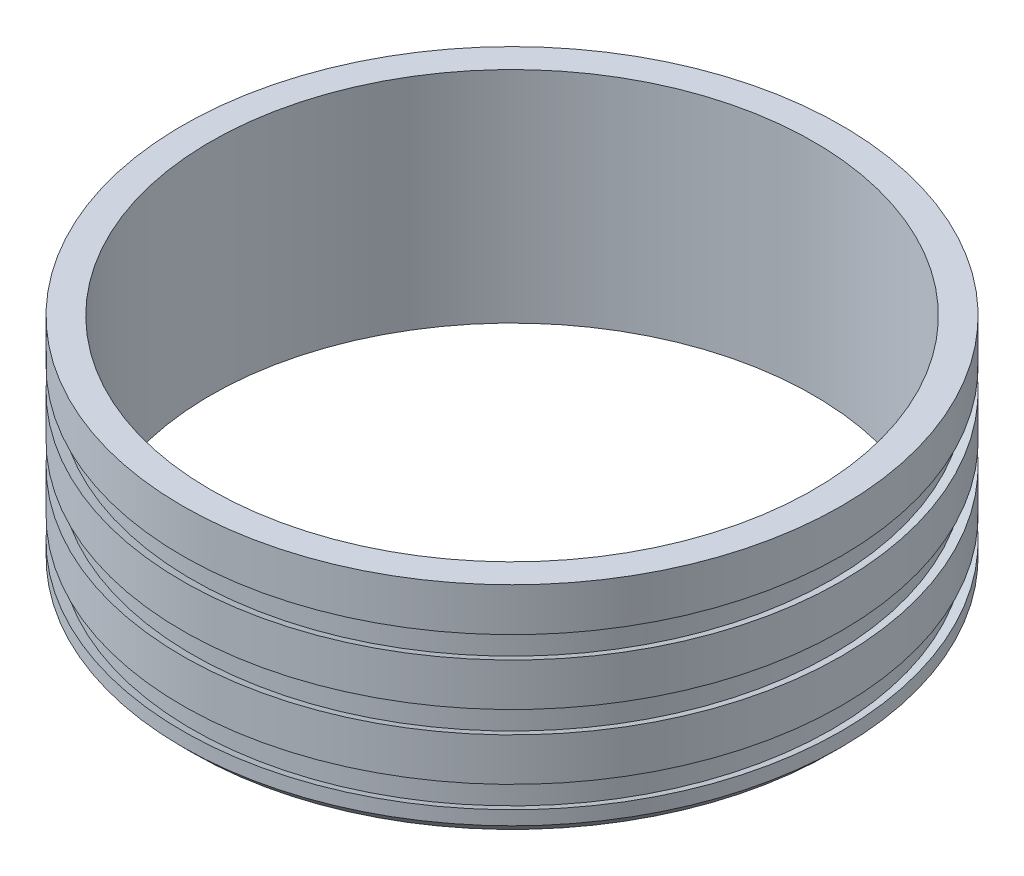
ISO-10303-21;
HEADER;
FILE_DESCRIPTION(('STEP AP214'),'2;1');
FILE_NAME('part.step','',(''),(''),'','','');
FILE_SCHEMA(('AUTOMOTIVE_DESIGN { 1 0 10303 214 1 1 1 1 }'));
ENDSEC;
DATA;
#1=APPLICATION_CONTEXT('core data for automotive mechanical design processes');
#2=APPLICATION_PROTOCOL_DEFINITION('international standard','automotive_design',2000,#1);
#3=PRODUCT_CONTEXT('',#1,'mechanical');
#4=PRODUCT('Part','Part','',(#3));
#5=PRODUCT_RELATED_PRODUCT_CATEGORY('part','',(#4));
#6=PRODUCT_DEFINITION_FORMATION('','',#4);
#7=PRODUCT_DEFINITION_CONTEXT('part definition',#1,'design');
#8=PRODUCT_DEFINITION('design','',#6,#7);
#9=PRODUCT_DEFINITION_SHAPE('','',#8);
#10=(LENGTH_UNIT() NAMED_UNIT(*) SI_UNIT(.MILLI.,.METRE.));
#11=(NAMED_UNIT(*) PLANE_ANGLE_UNIT() SI_UNIT($,.RADIAN.));
#12=(NAMED_UNIT(*) SI_UNIT($,.STERADIAN.) SOLID_ANGLE_UNIT());
#13=UNCERTAINTY_MEASURE_WITH_UNIT(LENGTH_MEASURE(1.E-05),#10,'distance_accuracy_value','');
#14=(GEOMETRIC_REPRESENTATION_CONTEXT(3) GLOBAL_UNCERTAINTY_ASSIGNED_CONTEXT((#13)) GLOBAL_UNIT_ASSIGNED_CONTEXT((#10,
#11,#12)) REPRESENTATION_CONTEXT('',''));
#15=CARTESIAN_POINT('',(0.,0.,0.));
#16=DIRECTION('',(0.,0.,1.));
#17=DIRECTION('',(1.,0.,0.));
#18=AXIS2_PLACEMENT_3D('',#15,#16,#17);
#19=CARTESIAN_POINT('',(0.,50.8,0.));
#20=DIRECTION('',(0.,-1.,0.));
#21=DIRECTION('',(0.,0.,-1.));
#22=AXIS2_PLACEMENT_3D('',#19,#20,#21);
#23=CYLINDRICAL_SURFACE('',#22,76.25);
#24=CARTESIAN_POINT('',(0.,50.8,0.));
#25=DIRECTION('',(0.,1.,0.));
#26=DIRECTION('',(0.,0.,1.));
#27=AXIS2_PLACEMENT_3D('',#24,#25,#26);
#28=CIRCLE('',#27,76.25);
#29=CARTESIAN_POINT('',(0.,50.8,76.25));
#30=VERTEX_POINT('',#29);
#31=EDGE_CURVE('E57',#30,#30,#28,.T.);
#32=ORIENTED_EDGE('',*,*,#31,.F.);
#33=EDGE_LOOP('',(#32));
#34=FACE_BOUND('',#33,.T.);
#35=CARTESIAN_POINT('',(0.,40.8,0.));
#36=DIRECTION('',(0.,-1.,0.));
#37=DIRECTION('',(1.,0.,0.));
#38=AXIS2_PLACEMENT_3D('',#35,#36,#37);
#39=CIRCLE('',#38,76.25);
#40=CARTESIAN_POINT('',(76.25,40.7999999999999,0.));
#41=VERTEX_POINT('',#40);
#42=EDGE_CURVE('E109',#41,#41,#39,.T.);
#43=ORIENTED_EDGE('',*,*,#42,.F.);
#44=EDGE_LOOP('',(#43));
#45=FACE_BOUND('',#44,.T.);
#46=ADVANCED_FACE('F43',(#34,#45),#23,.T.);
#47=CARTESIAN_POINT('',(0.,2.49999999999999,0.));
#48=DIRECTION('',(0.,1.,0.));
#49=DIRECTION('',(0.,0.,1.));
#50=AXIS2_PLACEMENT_3D('',#47,#48,#49);
#51=CIRCLE('',#50,76.25);
#52=CARTESIAN_POINT('',(0.,2.49999999999999,76.25));
#53=VERTEX_POINT('',#52);
#54=EDGE_CURVE('E52',#53,#53,#51,.T.);
#55=ORIENTED_EDGE('',*,*,#54,.T.);
#56=EDGE_LOOP('',(#55));
#57=FACE_BOUND('',#56,.T.);
#58=CARTESIAN_POINT('',(0.,5.71999999999995,0.));
#59=DIRECTION('',(0.,-1.,0.));
#60=DIRECTION('',(1.,0.,0.));
#61=AXIS2_PLACEMENT_3D('',#58,#59,#60);
#62=CIRCLE('',#61,76.25);
#63=CARTESIAN_POINT('',(76.2499999999999,5.71999999999991,0.));
#64=VERTEX_POINT('',#63);
#65=EDGE_CURVE('E73',#64,#64,#62,.T.);
#66=ORIENTED_EDGE('',*,*,#65,.T.);
#67=EDGE_LOOP('',(#66));
#68=FACE_BOUND('',#67,.T.);
#69=ADVANCED_FACE('F136',(#57,#68),#23,.T.);
#70=CARTESIAN_POINT('',(0.,50.8,0.));
#71=DIRECTION('',(0.,1.,0.));
#72=DIRECTION('',(0.,0.,1.));
#73=AXIS2_PLACEMENT_3D('',#70,#71,#72);
#74=PLANE('',#73);
#75=ORIENTED_EDGE('',*,*,#31,.T.);
#76=EDGE_LOOP('',(#75));
#77=FACE_BOUND('',#76,.T.);
#78=CARTESIAN_POINT('',(0.,50.8,0.));
#79=DIRECTION('',(0.,1.,0.));
#80=DIRECTION('',(0.,0.,1.));
#81=AXIS2_PLACEMENT_3D('',#78,#79,#80);
#82=CIRCLE('',#81,69.75);
#83=CARTESIAN_POINT('',(0.,50.8,69.75));
#84=VERTEX_POINT('',#83);
#85=EDGE_CURVE('E62',#84,#84,#82,.T.);
#86=ORIENTED_EDGE('',*,*,#85,.F.);
#87=EDGE_LOOP('',(#86));
#88=FACE_BOUND('',#87,.T.);
#89=ADVANCED_FACE('F144',(#77,#88),#74,.T.);
#90=CARTESIAN_POINT('',(0.,0.,0.));
#91=DIRECTION('',(0.,1.,0.));
#92=DIRECTION('',(0.,0.,1.));
#93=AXIS2_PLACEMENT_3D('',#90,#91,#92);
#94=PLANE('',#93);
#95=CARTESIAN_POINT('',(0.,0.,0.));
#96=DIRECTION('',(0.,1.,0.));
#97=DIRECTION('',(0.,0.,1.));
#98=AXIS2_PLACEMENT_3D('',#95,#96,#97);
#99=CIRCLE('',#98,73.75);
#100=CARTESIAN_POINT('',(0.,0.,73.75));
#101=VERTEX_POINT('',#100);
#102=EDGE_CURVE('E10',#101,#101,#99,.F.);
#103=ORIENTED_EDGE('',*,*,#102,.T.);
#104=EDGE_LOOP('',(#103));
#105=FACE_BOUND('',#104,.T.);
#106=CARTESIAN_POINT('',(0.,0.,0.));
#107=DIRECTION('',(0.,1.,0.));
#108=DIRECTION('',(0.,0.,1.));
#109=AXIS2_PLACEMENT_3D('',#106,#107,#108);
#110=CIRCLE('',#109,69.75);
#111=CARTESIAN_POINT('',(0.,0.,69.75));
#112=VERTEX_POINT('',#111);
#113=EDGE_CURVE('E65',#112,#112,#110,.T.);
#114=ORIENTED_EDGE('',*,*,#113,.T.);
#115=EDGE_LOOP('',(#114));
#116=FACE_BOUND('',#115,.T.);
#117=ADVANCED_FACE('F187',(#105,#116),#94,.F.);
#118=CARTESIAN_POINT('',(0.,50.8,0.));
#119=DIRECTION('',(0.,-1.,0.));
#120=DIRECTION('',(0.,0.,-1.));
#121=AXIS2_PLACEMENT_3D('',#118,#119,#120);
#122=CYLINDRICAL_SURFACE('',#121,69.75);
#123=ORIENTED_EDGE('',*,*,#85,.T.);
#124=EDGE_LOOP('',(#123));
#125=FACE_BOUND('',#124,.T.);
#126=ORIENTED_EDGE('',*,*,#113,.F.);
#127=EDGE_LOOP('',(#126));
#128=FACE_BOUND('',#127,.T.);
#129=ADVANCED_FACE('F183',(#125,#128),#122,.F.);
#130=CARTESIAN_POINT('',(0.,5.71999999999995,0.));
#131=DIRECTION('',(0.,1.,0.));
#132=DIRECTION('',(-1.,0.,0.));
#133=AXIS2_PLACEMENT_3D('',#130,#131,#132);
#134=CONICAL_SURFACE('',#133,76.25,1.22173047639603);
#135=CARTESIAN_POINT('',(0.,4.90106697290099,0.));
#136=DIRECTION('',(0.,-1.,0.));
#137=DIRECTION('',(1.,0.,0.));
#138=AXIS2_PLACEMENT_3D('',#135,#136,#137);
#139=CIRCLE('',#138,74.);
#140=CARTESIAN_POINT('',(73.9999999999999,4.90106697290094,0.));
#141=VERTEX_POINT('',#140);
#142=EDGE_CURVE('E86',#141,#141,#139,.T.);
#143=ORIENTED_EDGE('',*,*,#142,.T.);
#144=EDGE_LOOP('',(#143));
#145=FACE_BOUND('',#144,.T.);
#146=ORIENTED_EDGE('',*,*,#65,.F.);
#147=EDGE_LOOP('',(#146));
#148=FACE_BOUND('',#147,.T.);
#149=ADVANCED_FACE('F179',(#145,#148),#134,.F.);
#150=CARTESIAN_POINT('',(0.,11.6189330270989,0.));
#151=DIRECTION('',(0.,-1.,0.));
#152=DIRECTION('',(1.,0.,0.));
#153=AXIS2_PLACEMENT_3D('',#150,#151,#152);
#154=CONICAL_SURFACE('',#153,74.,1.22173047639603);
#155=CARTESIAN_POINT('',(0.,10.8,0.));
#156=DIRECTION('',(0.,-1.,0.));
#157=DIRECTION('',(1.,0.,0.));
#158=AXIS2_PLACEMENT_3D('',#155,#156,#157);
#159=CIRCLE('',#158,76.25);
#160=CARTESIAN_POINT('',(76.2499999999999,10.7999999999999,0.));
#161=VERTEX_POINT('',#160);
#162=EDGE_CURVE('E78',#161,#161,#159,.T.);
#163=ORIENTED_EDGE('',*,*,#162,.T.);
#164=EDGE_LOOP('',(#163));
#165=FACE_BOUND('',#164,.T.);
#166=CARTESIAN_POINT('',(0.,11.6189330270989,0.));
#167=DIRECTION('',(0.,-1.,0.));
#168=DIRECTION('',(1.,0.,0.));
#169=AXIS2_PLACEMENT_3D('',#166,#167,#168);
#170=CIRCLE('',#169,74.);
#171=CARTESIAN_POINT('',(73.9999999999999,11.6189330270989,0.));
#172=VERTEX_POINT('',#171);
#173=EDGE_CURVE('E82',#172,#172,#170,.T.);
#174=ORIENTED_EDGE('',*,*,#173,.F.);
#175=EDGE_LOOP('',(#174));
#176=FACE_BOUND('',#175,.T.);
#177=ADVANCED_FACE('F166',(#165,#176),#154,.F.);
#178=CARTESIAN_POINT('',(0.,0.,0.));
#179=DIRECTION('',(0.,-1.,0.));
#180=DIRECTION('',(1.,0.,0.));
#181=AXIS2_PLACEMENT_3D('',#178,#179,#180);
#182=CYLINDRICAL_SURFACE('',#181,74.);
#183=ORIENTED_EDGE('',*,*,#173,.T.);
#184=EDGE_LOOP('',(#183));
#185=FACE_BOUND('',#184,.T.);
#186=ORIENTED_EDGE('',*,*,#142,.F.);
#187=EDGE_LOOP('',(#186));
#188=FACE_BOUND('',#187,.T.);
#189=ADVANCED_FACE('F161',(#185,#188),#182,.T.);
#190=CARTESIAN_POINT('',(0.,35.72,0.));
#191=DIRECTION('',(0.,1.,0.));
#192=DIRECTION('',(-1.,0.,0.));
#193=AXIS2_PLACEMENT_3D('',#190,#191,#192);
#194=CONICAL_SURFACE('',#193,76.25,1.22173047639603);
#195=CARTESIAN_POINT('',(0.,34.901066972901,0.));
#196=DIRECTION('',(0.,-1.,0.));
#197=DIRECTION('',(1.,0.,0.));
#198=AXIS2_PLACEMENT_3D('',#195,#196,#197);
#199=CIRCLE('',#198,74.);
#200=CARTESIAN_POINT('',(74.,34.9010669729009,0.));
#201=VERTEX_POINT('',#200);
#202=EDGE_CURVE('E94',#201,#201,#199,.T.);
#203=ORIENTED_EDGE('',*,*,#202,.T.);
#204=EDGE_LOOP('',(#203));
#205=FACE_BOUND('',#204,.T.);
#206=CARTESIAN_POINT('',(0.,35.72,0.));
#207=DIRECTION('',(0.,-1.,0.));
#208=DIRECTION('',(1.,0.,0.));
#209=AXIS2_PLACEMENT_3D('',#206,#207,#208);
#210=CIRCLE('',#209,76.25);
#211=CARTESIAN_POINT('',(76.25,35.7199999999999,0.));
#212=VERTEX_POINT('',#211);
#213=EDGE_CURVE('E69',#212,#212,#210,.T.);
#214=ORIENTED_EDGE('',*,*,#213,.F.);
#215=EDGE_LOOP('',(#214));
#216=FACE_BOUND('',#215,.T.);
#217=ADVANCED_FACE('F121',(#205,#216),#194,.F.);
#218=CARTESIAN_POINT('',(0.,41.6189330270989,0.));
#219=DIRECTION('',(0.,-1.,0.));
#220=DIRECTION('',(1.,0.,0.));
#221=AXIS2_PLACEMENT_3D('',#218,#219,#220);
#222=CONICAL_SURFACE('',#221,74.,1.22173047639603);
#223=ORIENTED_EDGE('',*,*,#42,.T.);
#224=EDGE_LOOP('',(#223));
#225=FACE_BOUND('',#224,.T.);
#226=CARTESIAN_POINT('',(0.,41.6189330270989,0.));
#227=DIRECTION('',(0.,-1.,0.));
#228=DIRECTION('',(1.,0.,0.));
#229=AXIS2_PLACEMENT_3D('',#226,#227,#228);
#230=CIRCLE('',#229,74.);
#231=CARTESIAN_POINT('',(74.,41.6189330270989,0.));
#232=VERTEX_POINT('',#231);
#233=EDGE_CURVE('E113',#232,#232,#230,.T.);
#234=ORIENTED_EDGE('',*,*,#233,.F.);
#235=EDGE_LOOP('',(#234));
#236=FACE_BOUND('',#235,.T.);
#237=ADVANCED_FACE('F127',(#225,#236),#222,.F.);
#238=CARTESIAN_POINT('',(0.,0.,0.));
#239=DIRECTION('',(0.,-1.,0.));
#240=DIRECTION('',(1.,0.,0.));
#241=AXIS2_PLACEMENT_3D('',#238,#239,#240);
#242=CYLINDRICAL_SURFACE('',#241,74.);
#243=ORIENTED_EDGE('',*,*,#233,.T.);
#244=EDGE_LOOP('',(#243));
#245=FACE_BOUND('',#244,.T.);
#246=ORIENTED_EDGE('',*,*,#202,.F.);
#247=EDGE_LOOP('',(#246));
#248=FACE_BOUND('',#247,.T.);
#249=ADVANCED_FACE('F124',(#245,#248),#242,.T.);
#250=ORIENTED_EDGE('',*,*,#162,.F.);
#251=EDGE_LOOP('',(#250));
#252=FACE_BOUND('',#251,.T.);
#253=CARTESIAN_POINT('',(0.,20.72,0.));
#254=DIRECTION('',(0.,-1.,0.));
#255=DIRECTION('',(1.,0.,0.));
#256=AXIS2_PLACEMENT_3D('',#253,#254,#255);
#257=CIRCLE('',#256,76.25);
#258=CARTESIAN_POINT('',(76.25,20.7199999999999,0.));
#259=VERTEX_POINT('',#258);
#260=EDGE_CURVE('E90',#259,#259,#257,.T.);
#261=ORIENTED_EDGE('',*,*,#260,.T.);
#262=EDGE_LOOP('',(#261));
#263=FACE_BOUND('',#262,.T.);
#264=ADVANCED_FACE('F126',(#252,#263),#23,.T.);
#265=CARTESIAN_POINT('',(0.,25.8,0.));
#266=DIRECTION('',(0.,-1.,0.));
#267=DIRECTION('',(1.,0.,0.));
#268=AXIS2_PLACEMENT_3D('',#265,#266,#267);
#269=CIRCLE('',#268,76.25);
#270=CARTESIAN_POINT('',(76.25,25.7999999999999,0.));
#271=VERTEX_POINT('',#270);
#272=EDGE_CURVE('E95',#271,#271,#269,.T.);
#273=ORIENTED_EDGE('',*,*,#272,.F.);
#274=EDGE_LOOP('',(#273));
#275=FACE_BOUND('',#274,.T.);
#276=ORIENTED_EDGE('',*,*,#213,.T.);
#277=EDGE_LOOP('',(#276));
#278=FACE_BOUND('',#277,.T.);
#279=ADVANCED_FACE('F134',(#275,#278),#23,.T.);
#280=CARTESIAN_POINT('',(0.,20.72,0.));
#281=DIRECTION('',(0.,1.,0.));
#282=DIRECTION('',(-1.,0.,0.));
#283=AXIS2_PLACEMENT_3D('',#280,#281,#282);
#284=CONICAL_SURFACE('',#283,76.25,1.22173047639603);
#285=CARTESIAN_POINT('',(0.,19.901066972901,0.));
#286=DIRECTION('',(0.,-1.,0.));
#287=DIRECTION('',(1.,0.,0.));
#288=AXIS2_PLACEMENT_3D('',#285,#286,#287);
#289=CIRCLE('',#288,74.);
#290=CARTESIAN_POINT('',(74.,19.9010669729009,0.));
#291=VERTEX_POINT('',#290);
#292=EDGE_CURVE('E77',#291,#291,#289,.T.);
#293=ORIENTED_EDGE('',*,*,#292,.T.);
#294=EDGE_LOOP('',(#293));
#295=FACE_BOUND('',#294,.T.);
#296=ORIENTED_EDGE('',*,*,#260,.F.);
#297=EDGE_LOOP('',(#296));
#298=FACE_BOUND('',#297,.T.);
#299=ADVANCED_FACE('F149',(#295,#298),#284,.F.);
#300=CARTESIAN_POINT('',(0.,26.6189330270989,0.));
#301=DIRECTION('',(0.,-1.,0.));
#302=DIRECTION('',(1.,0.,0.));
#303=AXIS2_PLACEMENT_3D('',#300,#301,#302);
#304=CONICAL_SURFACE('',#303,74.,1.22173047639603);
#305=ORIENTED_EDGE('',*,*,#272,.T.);
#306=EDGE_LOOP('',(#305));
#307=FACE_BOUND('',#306,.T.);
#308=CARTESIAN_POINT('',(0.,26.6189330270989,0.));
#309=DIRECTION('',(0.,-1.,0.));
#310=DIRECTION('',(1.,0.,0.));
#311=AXIS2_PLACEMENT_3D('',#308,#309,#310);
#312=CIRCLE('',#311,74.);
#313=CARTESIAN_POINT('',(74.,26.6189330270989,0.));
#314=VERTEX_POINT('',#313);
#315=EDGE_CURVE('E99',#314,#314,#312,.T.);
#316=ORIENTED_EDGE('',*,*,#315,.F.);
#317=EDGE_LOOP('',(#316));
#318=FACE_BOUND('',#317,.T.);
#319=ADVANCED_FACE('F154',(#307,#318),#304,.F.);
#320=CARTESIAN_POINT('',(0.,0.,0.));
#321=DIRECTION('',(0.,-1.,0.));
#322=DIRECTION('',(1.,0.,0.));
#323=AXIS2_PLACEMENT_3D('',#320,#321,#322);
#324=CYLINDRICAL_SURFACE('',#323,74.);
#325=ORIENTED_EDGE('',*,*,#315,.T.);
#326=EDGE_LOOP('',(#325));
#327=FACE_BOUND('',#326,.T.);
#328=ORIENTED_EDGE('',*,*,#292,.F.);
#329=EDGE_LOOP('',(#328));
#330=FACE_BOUND('',#329,.T.);
#331=ADVANCED_FACE('F170',(#327,#330),#324,.T.);
#332=CARTESIAN_POINT('',(0.,2.49999999999999,0.));
#333=DIRECTION('',(0.,1.,0.));
#334=DIRECTION('',(0.,0.,1.));
#335=AXIS2_PLACEMENT_3D('',#332,#333,#334);
#336=CONICAL_SURFACE('',#335,76.25,0.785398163397451);
#337=ORIENTED_EDGE('',*,*,#102,.F.);
#338=EDGE_LOOP('',(#337));
#339=FACE_BOUND('',#338,.T.);
#340=ORIENTED_EDGE('',*,*,#54,.F.);
#341=EDGE_LOOP('',(#340));
#342=FACE_BOUND('',#341,.T.);
#343=ADVANCED_FACE('F46',(#339,#342),#336,.T.);
#344=CLOSED_SHELL('',(#46,#69,#89,#117,#129,#149,#177,#189,#217,#237,#249,#264,#279,#299,#319,
#331,#343));
#345=MANIFOLD_SOLID_BREP('B2',#344);
#346=ADVANCED_BREP_SHAPE_REPRESENTATION('',(#18,#345),#14);
#347=SHAPE_DEFINITION_REPRESENTATION(#9,#346);
ENDSEC;
END-ISO-10303-21;
